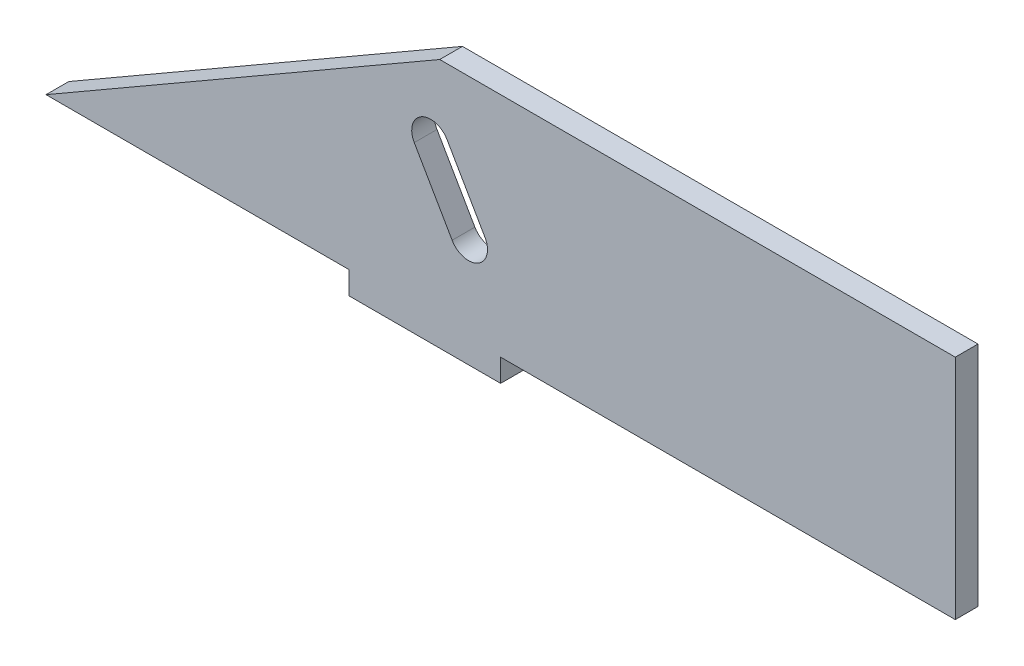
ISO-10303-21;
HEADER;
FILE_DESCRIPTION(('STEP AP214'),'2;1');
FILE_NAME('part.step','',(''),(''),'','','');
FILE_SCHEMA(('AUTOMOTIVE_DESIGN { 1 0 10303 214 1 1 1 1 }'));
ENDSEC;
DATA;
#1=APPLICATION_CONTEXT('core data for automotive mechanical design processes');
#2=APPLICATION_PROTOCOL_DEFINITION('international standard','automotive_design',2000,#1);
#3=PRODUCT_CONTEXT('',#1,'mechanical');
#4=PRODUCT('Part','Part','',(#3));
#5=PRODUCT_RELATED_PRODUCT_CATEGORY('part','',(#4));
#6=PRODUCT_DEFINITION_FORMATION('','',#4);
#7=PRODUCT_DEFINITION_CONTEXT('part definition',#1,'design');
#8=PRODUCT_DEFINITION('design','',#6,#7);
#9=PRODUCT_DEFINITION_SHAPE('','',#8);
#10=(LENGTH_UNIT() NAMED_UNIT(*) SI_UNIT(.MILLI.,.METRE.));
#11=(NAMED_UNIT(*) PLANE_ANGLE_UNIT() SI_UNIT($,.RADIAN.));
#12=(NAMED_UNIT(*) SI_UNIT($,.STERADIAN.) SOLID_ANGLE_UNIT());
#13=UNCERTAINTY_MEASURE_WITH_UNIT(LENGTH_MEASURE(1.E-05),#10,'distance_accuracy_value','');
#14=(GEOMETRIC_REPRESENTATION_CONTEXT(3) GLOBAL_UNCERTAINTY_ASSIGNED_CONTEXT((#13)) GLOBAL_UNIT_ASSIGNED_CONTEXT((#10,
#11,#12)) REPRESENTATION_CONTEXT('',''));
#15=CARTESIAN_POINT('',(0.,0.,0.));
#16=DIRECTION('',(0.,0.,1.));
#17=DIRECTION('',(1.,0.,0.));
#18=AXIS2_PLACEMENT_3D('',#15,#16,#17);
#19=CARTESIAN_POINT('',(50.,15.,3.));
#20=DIRECTION('',(0.,-1.,0.));
#21=DIRECTION('',(1.,0.,0.));
#22=AXIS2_PLACEMENT_3D('',#19,#20,#21);
#23=PLANE('',#22);
#24=DIRECTION('',(0.,0.,-1.));
#25=VECTOR('',#24,1.);
#26=CARTESIAN_POINT('',(1.96152422706574,15.,138.433806901228));
#27=LINE('',#26,#25);
#28=CARTESIAN_POINT('',(1.96152422706574,15.,3.00000000000006));
#29=VERTEX_POINT('',#28);
#30=CARTESIAN_POINT('',(1.9615242270659,15.,0.));
#31=VERTEX_POINT('',#30);
#32=EDGE_CURVE('E195',#29,#31,#27,.T.);
#33=ORIENTED_EDGE('',*,*,#32,.F.);
#34=DIRECTION('',(-1.,0.,0.));
#35=VECTOR('',#34,1.);
#36=CARTESIAN_POINT('',(50.,15.,3.));
#37=LINE('',#36,#35);
#38=CARTESIAN_POINT('',(70.,15.,3.));
#39=VERTEX_POINT('',#38);
#40=EDGE_CURVE('E141',#39,#29,#37,.T.);
#41=ORIENTED_EDGE('',*,*,#40,.F.);
#42=DIRECTION('',(0.,0.,1.));
#43=VECTOR('',#42,1.);
#44=CARTESIAN_POINT('',(70.,15.,3.));
#45=LINE('',#44,#43);
#46=CARTESIAN_POINT('',(70.,15.,0.));
#47=VERTEX_POINT('',#46);
#48=EDGE_CURVE('E157',#47,#39,#45,.T.);
#49=ORIENTED_EDGE('',*,*,#48,.F.);
#50=DIRECTION('',(-1.,0.,0.));
#51=VECTOR('',#50,1.);
#52=CARTESIAN_POINT('',(50.,15.,0.));
#53=LINE('',#52,#51);
#54=EDGE_CURVE('E205',#47,#31,#53,.T.);
#55=ORIENTED_EDGE('',*,*,#54,.T.);
#56=EDGE_LOOP('',(#33,#41,#49,#55));
#57=FACE_BOUND('',#56,.T.);
#58=ADVANCED_FACE('F39',(#57),#23,.F.);
#59=CARTESIAN_POINT('',(-10.,-15.,3.));
#60=DIRECTION('',(0.,1.,0.));
#61=DIRECTION('',(-1.,0.,0.));
#62=AXIS2_PLACEMENT_3D('',#59,#60,#61);
#63=PLANE('',#62);
#64=DIRECTION('',(1.,0.,0.));
#65=VECTOR('',#64,1.);
#66=CARTESIAN_POINT('',(-10.,-15.,0.));
#67=LINE('',#66,#65);
#68=CARTESIAN_POINT('',(-50.,-15.,0.));
#69=VERTEX_POINT('',#68);
#70=CARTESIAN_POINT('',(-10.,-15.,0.));
#71=VERTEX_POINT('',#70);
#72=EDGE_CURVE('E194',#69,#71,#67,.T.);
#73=ORIENTED_EDGE('',*,*,#72,.T.);
#74=DIRECTION('',(0.,0.,-1.));
#75=VECTOR('',#74,1.);
#76=CARTESIAN_POINT('',(-10.,-15.,3.));
#77=LINE('',#76,#75);
#78=CARTESIAN_POINT('',(-10.,-15.,3.));
#79=VERTEX_POINT('',#78);
#80=EDGE_CURVE('E242',#79,#71,#77,.T.);
#81=ORIENTED_EDGE('',*,*,#80,.F.);
#82=DIRECTION('',(1.,0.,0.));
#83=VECTOR('',#82,1.);
#84=CARTESIAN_POINT('',(-10.,-15.,3.));
#85=LINE('',#84,#83);
#86=CARTESIAN_POINT('',(-50.,-15.,3.));
#87=VERTEX_POINT('',#86);
#88=EDGE_CURVE('E201',#87,#79,#85,.T.);
#89=ORIENTED_EDGE('',*,*,#88,.F.);
#90=DIRECTION('',(0.,0.,-1.));
#91=VECTOR('',#90,1.);
#92=CARTESIAN_POINT('',(-50.,-15.,3.));
#93=LINE('',#92,#91);
#94=EDGE_CURVE('E246',#87,#69,#93,.T.);
#95=ORIENTED_EDGE('',*,*,#94,.T.);
#96=EDGE_LOOP('',(#73,#81,#89,#95));
#97=FACE_BOUND('',#96,.T.);
#98=ADVANCED_FACE('F41',(#97),#63,.F.);
#99=CARTESIAN_POINT('',(-10.,-15.,3.));
#100=DIRECTION('',(1.,0.,0.));
#101=DIRECTION('',(0.,0.,-1.));
#102=AXIS2_PLACEMENT_3D('',#99,#100,#101);
#103=PLANE('',#102);
#104=DIRECTION('',(0.,-1.,0.));
#105=VECTOR('',#104,1.);
#106=CARTESIAN_POINT('',(-10.,-15.,0.));
#107=LINE('',#106,#105);
#108=CARTESIAN_POINT('',(-10.,-18.,0.));
#109=VERTEX_POINT('',#108);
#110=EDGE_CURVE('E218',#71,#109,#107,.T.);
#111=ORIENTED_EDGE('',*,*,#110,.T.);
#112=DIRECTION('',(0.,0.,-1.));
#113=VECTOR('',#112,1.);
#114=CARTESIAN_POINT('',(-10.,-18.,3.));
#115=LINE('',#114,#113);
#116=CARTESIAN_POINT('',(-10.,-18.,3.));
#117=VERTEX_POINT('',#116);
#118=EDGE_CURVE('E238',#117,#109,#115,.T.);
#119=ORIENTED_EDGE('',*,*,#118,.F.);
#120=DIRECTION('',(0.,-1.,0.));
#121=VECTOR('',#120,1.);
#122=CARTESIAN_POINT('',(-10.,-15.,3.));
#123=LINE('',#122,#121);
#124=EDGE_CURVE('E204',#79,#117,#123,.T.);
#125=ORIENTED_EDGE('',*,*,#124,.F.);
#126=ORIENTED_EDGE('',*,*,#80,.T.);
#127=EDGE_LOOP('',(#111,#119,#125,#126));
#128=FACE_BOUND('',#127,.T.);
#129=ADVANCED_FACE('F291',(#128),#103,.F.);
#130=CARTESIAN_POINT('',(-10.,-18.,3.));
#131=DIRECTION('',(0.,1.,0.));
#132=DIRECTION('',(0.,0.,1.));
#133=AXIS2_PLACEMENT_3D('',#130,#131,#132);
#134=PLANE('',#133);
#135=DIRECTION('',(1.,0.,0.));
#136=VECTOR('',#135,1.);
#137=CARTESIAN_POINT('',(-10.,-18.,0.));
#138=LINE('',#137,#136);
#139=CARTESIAN_POINT('',(10.,-18.,0.));
#140=VERTEX_POINT('',#139);
#141=EDGE_CURVE('E221',#109,#140,#138,.T.);
#142=ORIENTED_EDGE('',*,*,#141,.T.);
#143=DIRECTION('',(0.,0.,-1.));
#144=VECTOR('',#143,1.);
#145=CARTESIAN_POINT('',(10.,-18.,3.));
#146=LINE('',#145,#144);
#147=CARTESIAN_POINT('',(10.,-18.,3.));
#148=VERTEX_POINT('',#147);
#149=EDGE_CURVE('E234',#148,#140,#146,.T.);
#150=ORIENTED_EDGE('',*,*,#149,.F.);
#151=DIRECTION('',(1.,0.,0.));
#152=VECTOR('',#151,1.);
#153=CARTESIAN_POINT('',(-10.,-18.,3.));
#154=LINE('',#153,#152);
#155=EDGE_CURVE('E208',#117,#148,#154,.T.);
#156=ORIENTED_EDGE('',*,*,#155,.F.);
#157=ORIENTED_EDGE('',*,*,#118,.T.);
#158=EDGE_LOOP('',(#142,#150,#156,#157));
#159=FACE_BOUND('',#158,.T.);
#160=ADVANCED_FACE('F302',(#159),#134,.F.);
#161=CARTESIAN_POINT('',(10.,-18.,3.));
#162=DIRECTION('',(-1.,0.,0.));
#163=DIRECTION('',(0.,-1.,0.));
#164=AXIS2_PLACEMENT_3D('',#161,#162,#163);
#165=PLANE('',#164);
#166=DIRECTION('',(0.,1.,0.));
#167=VECTOR('',#166,1.);
#168=CARTESIAN_POINT('',(10.,-18.,0.));
#169=LINE('',#168,#167);
#170=CARTESIAN_POINT('',(10.,-15.,0.));
#171=VERTEX_POINT('',#170);
#172=EDGE_CURVE('E224',#140,#171,#169,.T.);
#173=ORIENTED_EDGE('',*,*,#172,.T.);
#174=DIRECTION('',(0.,0.,-1.));
#175=VECTOR('',#174,1.);
#176=CARTESIAN_POINT('',(10.,-15.,3.));
#177=LINE('',#176,#175);
#178=CARTESIAN_POINT('',(10.,-15.,3.));
#179=VERTEX_POINT('',#178);
#180=EDGE_CURVE('E215',#179,#171,#177,.T.);
#181=ORIENTED_EDGE('',*,*,#180,.F.);
#182=DIRECTION('',(0.,1.,0.));
#183=VECTOR('',#182,1.);
#184=CARTESIAN_POINT('',(10.,-18.,3.));
#185=LINE('',#184,#183);
#186=EDGE_CURVE('E136',#148,#179,#185,.T.);
#187=ORIENTED_EDGE('',*,*,#186,.F.);
#188=ORIENTED_EDGE('',*,*,#149,.T.);
#189=EDGE_LOOP('',(#173,#181,#187,#188));
#190=FACE_BOUND('',#189,.T.);
#191=ADVANCED_FACE('F299',(#190),#165,.F.);
#192=CARTESIAN_POINT('',(50.,-15.,3.));
#193=DIRECTION('',(0.,1.,0.));
#194=DIRECTION('',(-1.,0.,0.));
#195=AXIS2_PLACEMENT_3D('',#192,#193,#194);
#196=PLANE('',#195);
#197=DIRECTION('',(1.,0.,0.));
#198=VECTOR('',#197,1.);
#199=CARTESIAN_POINT('',(50.,-15.,0.));
#200=LINE('',#199,#198);
#201=CARTESIAN_POINT('',(70.,-15.,0.));
#202=VERTEX_POINT('',#201);
#203=EDGE_CURVE('E147',#171,#202,#200,.T.);
#204=ORIENTED_EDGE('',*,*,#203,.T.);
#205=DIRECTION('',(0.,0.,-1.));
#206=VECTOR('',#205,1.);
#207=CARTESIAN_POINT('',(70.,-15.,3.));
#208=LINE('',#207,#206);
#209=CARTESIAN_POINT('',(70.,-15.,3.));
#210=VERTEX_POINT('',#209);
#211=EDGE_CURVE('E144',#210,#202,#208,.T.);
#212=ORIENTED_EDGE('',*,*,#211,.F.);
#213=DIRECTION('',(1.,0.,0.));
#214=VECTOR('',#213,1.);
#215=CARTESIAN_POINT('',(50.,-15.,3.));
#216=LINE('',#215,#214);
#217=EDGE_CURVE('E130',#179,#210,#216,.T.);
#218=ORIENTED_EDGE('',*,*,#217,.F.);
#219=ORIENTED_EDGE('',*,*,#180,.T.);
#220=EDGE_LOOP('',(#204,#212,#218,#219));
#221=FACE_BOUND('',#220,.T.);
#222=ADVANCED_FACE('F145',(#221),#196,.F.);
#223=CARTESIAN_POINT('',(0.,0.,3.));
#224=DIRECTION('',(0.,0.,1.));
#225=DIRECTION('',(1.,0.,0.));
#226=AXIS2_PLACEMENT_3D('',#223,#224,#225);
#227=PLANE('',#226);
#228=CARTESIAN_POINT('',(5.76537180435926,-3.58845726812014,3.));
#229=DIRECTION('',(0.,0.,1.));
#230=DIRECTION('',(1.,0.,0.));
#231=AXIS2_PLACEMENT_3D('',#228,#229,#230);
#232=CIRCLE('',#231,2.5);
#233=CARTESIAN_POINT('',(3.60030829489816,-4.83845726812014,3.));
#234=VERTEX_POINT('',#233);
#235=CARTESIAN_POINT('',(7.93043531382035,-2.33845726812014,3.));
#236=VERTEX_POINT('',#235);
#237=EDGE_CURVE('E55',#234,#236,#232,.T.);
#238=ORIENTED_EDGE('',*,*,#237,.F.);
#239=DIRECTION('',(0.5,-0.866025403784439,0.));
#240=VECTOR('',#239,1.);
#241=CARTESIAN_POINT('',(3.60030829489816,-4.83845726812014,3.));
#242=LINE('',#241,#240);
#243=CARTESIAN_POINT('',(-1.39969170510184,3.82179676972425,3.));
#244=VERTEX_POINT('',#243);
#245=EDGE_CURVE('E174',#244,#234,#242,.T.);
#246=ORIENTED_EDGE('',*,*,#245,.F.);
#247=CARTESIAN_POINT('',(0.765371804359261,5.07179676972425,3.));
#248=DIRECTION('',(0.,0.,1.));
#249=DIRECTION('',(1.,0.,0.));
#250=AXIS2_PLACEMENT_3D('',#247,#248,#249);
#251=CIRCLE('',#250,2.5);
#252=CARTESIAN_POINT('',(2.93043531382036,6.32179676972425,3.));
#253=VERTEX_POINT('',#252);
#254=EDGE_CURVE('E170',#253,#244,#251,.T.);
#255=ORIENTED_EDGE('',*,*,#254,.F.);
#256=DIRECTION('',(-0.5,0.866025403784439,0.));
#257=VECTOR('',#256,1.);
#258=CARTESIAN_POINT('',(7.93043531382035,-2.33845726812014,3.));
#259=LINE('',#258,#257);
#260=EDGE_CURVE('E167',#236,#253,#259,.T.);
#261=ORIENTED_EDGE('',*,*,#260,.F.);
#262=EDGE_LOOP('',(#238,#246,#255,#261));
#263=FACE_BOUND('',#262,.T.);
#264=DIRECTION('',(0.866025403784436,0.500000000000004,0.));
#265=VECTOR('',#264,1.);
#266=CARTESIAN_POINT('',(-50.,-15.,3.));
#267=LINE('',#266,#265);
#268=EDGE_CURVE('E190',#87,#29,#267,.T.);
#269=ORIENTED_EDGE('',*,*,#268,.F.);
#270=ORIENTED_EDGE('',*,*,#88,.T.);
#271=ORIENTED_EDGE('',*,*,#124,.T.);
#272=ORIENTED_EDGE('',*,*,#155,.T.);
#273=ORIENTED_EDGE('',*,*,#186,.T.);
#274=ORIENTED_EDGE('',*,*,#217,.T.);
#275=DIRECTION('',(0.,-1.,0.));
#276=VECTOR('',#275,1.);
#277=CARTESIAN_POINT('',(70.,-15.,3.));
#278=LINE('',#277,#276);
#279=EDGE_CURVE('E134',#39,#210,#278,.T.);
#280=ORIENTED_EDGE('',*,*,#279,.F.);
#281=ORIENTED_EDGE('',*,*,#40,.T.);
#282=EDGE_LOOP('',(#269,#270,#271,#272,#273,#274,#280,#281));
#283=FACE_BOUND('',#282,.T.);
#284=ADVANCED_FACE('F132',(#263,#283),#227,.T.);
#285=CARTESIAN_POINT('',(0.,0.,0.));
#286=DIRECTION('',(0.,0.,1.));
#287=DIRECTION('',(1.,0.,0.));
#288=AXIS2_PLACEMENT_3D('',#285,#286,#287);
#289=PLANE('',#288);
#290=DIRECTION('',(0.5,-0.866025403784439,0.));
#291=VECTOR('',#290,1.);
#292=CARTESIAN_POINT('',(0.605117766514875,0.349364905388788,0.));
#293=LINE('',#292,#291);
#294=CARTESIAN_POINT('',(-1.39969170510184,3.82179676972425,0.));
#295=VERTEX_POINT('',#294);
#296=CARTESIAN_POINT('',(3.60030829489816,-4.83845726812014,0.));
#297=VERTEX_POINT('',#296);
#298=EDGE_CURVE('E48',#295,#297,#293,.T.);
#299=ORIENTED_EDGE('',*,*,#298,.T.);
#300=CARTESIAN_POINT('',(5.76537180435926,-3.58845726812014,0.));
#301=DIRECTION('',(0.,0.,1.));
#302=DIRECTION('',(1.,0.,0.));
#303=AXIS2_PLACEMENT_3D('',#300,#301,#302);
#304=CIRCLE('',#303,2.5);
#305=CARTESIAN_POINT('',(7.93043531382035,-2.33845726812014,0.));
#306=VERTEX_POINT('',#305);
#307=EDGE_CURVE('E11',#297,#306,#304,.T.);
#308=ORIENTED_EDGE('',*,*,#307,.T.);
#309=DIRECTION('',(-0.5,0.866025403784439,0.));
#310=VECTOR('',#309,1.);
#311=CARTESIAN_POINT('',(4.93524478543707,2.84936490538879,0.));
#312=LINE('',#311,#310);
#313=CARTESIAN_POINT('',(2.93043531382036,6.32179676972425,0.));
#314=VERTEX_POINT('',#313);
#315=EDGE_CURVE('E250',#306,#314,#312,.T.);
#316=ORIENTED_EDGE('',*,*,#315,.T.);
#317=CARTESIAN_POINT('',(0.765371804359261,5.07179676972425,0.));
#318=DIRECTION('',(0.,0.,1.));
#319=DIRECTION('',(1.,0.,0.));
#320=AXIS2_PLACEMENT_3D('',#317,#318,#319);
#321=CIRCLE('',#320,2.5);
#322=EDGE_CURVE('E254',#314,#295,#321,.T.);
#323=ORIENTED_EDGE('',*,*,#322,.T.);
#324=EDGE_LOOP('',(#299,#308,#316,#323));
#325=FACE_BOUND('',#324,.T.);
#326=ORIENTED_EDGE('',*,*,#72,.F.);
#327=DIRECTION('',(0.866025403784436,0.500000000000004,0.));
#328=VECTOR('',#327,1.);
#329=CARTESIAN_POINT('',(-50.,-15.,0.));
#330=LINE('',#329,#328);
#331=EDGE_CURVE('E182',#69,#31,#330,.T.);
#332=ORIENTED_EDGE('',*,*,#331,.T.);
#333=ORIENTED_EDGE('',*,*,#54,.F.);
#334=DIRECTION('',(0.,1.,0.));
#335=VECTOR('',#334,1.);
#336=CARTESIAN_POINT('',(70.,-15.,0.));
#337=LINE('',#336,#335);
#338=EDGE_CURVE('E152',#202,#47,#337,.T.);
#339=ORIENTED_EDGE('',*,*,#338,.F.);
#340=ORIENTED_EDGE('',*,*,#203,.F.);
#341=ORIENTED_EDGE('',*,*,#172,.F.);
#342=ORIENTED_EDGE('',*,*,#141,.F.);
#343=ORIENTED_EDGE('',*,*,#110,.F.);
#344=EDGE_LOOP('',(#326,#332,#333,#339,#340,#341,#342,#343));
#345=FACE_BOUND('',#344,.T.);
#346=ADVANCED_FACE('F260',(#325,#345),#289,.F.);
#347=CARTESIAN_POINT('',(-50.,-15.,138.433806901228));
#348=DIRECTION('',(-0.500000000000004,0.866025403784436,0.));
#349=DIRECTION('',(-0.866025403784436,-0.500000000000004,0.));
#350=AXIS2_PLACEMENT_3D('',#347,#348,#349);
#351=PLANE('',#350);
#352=ORIENTED_EDGE('',*,*,#94,.F.);
#353=ORIENTED_EDGE('',*,*,#268,.T.);
#354=ORIENTED_EDGE('',*,*,#32,.T.);
#355=ORIENTED_EDGE('',*,*,#331,.F.);
#356=EDGE_LOOP('',(#352,#353,#354,#355));
#357=FACE_BOUND('',#356,.T.);
#358=ADVANCED_FACE('F275',(#357),#351,.T.);
#359=CARTESIAN_POINT('',(5.76537180435926,-3.58845726812014,-1.));
#360=DIRECTION('',(0.,0.,1.));
#361=DIRECTION('',(1.,0.,0.));
#362=AXIS2_PLACEMENT_3D('',#359,#360,#361);
#363=CYLINDRICAL_SURFACE('',#362,2.5);
#364=DIRECTION('',(0.,0.,1.));
#365=VECTOR('',#364,1.);
#366=CARTESIAN_POINT('',(3.60030829489816,-4.83845726812014,-1.));
#367=LINE('',#366,#365);
#368=EDGE_CURVE('E179',#297,#234,#367,.T.);
#369=ORIENTED_EDGE('',*,*,#368,.T.);
#370=ORIENTED_EDGE('',*,*,#237,.T.);
#371=DIRECTION('',(0.,0.,1.));
#372=VECTOR('',#371,1.);
#373=CARTESIAN_POINT('',(7.93043531382035,-2.33845726812014,-1.));
#374=LINE('',#373,#372);
#375=EDGE_CURVE('E178',#306,#236,#374,.T.);
#376=ORIENTED_EDGE('',*,*,#375,.F.);
#377=ORIENTED_EDGE('',*,*,#307,.F.);
#378=EDGE_LOOP('',(#369,#370,#376,#377));
#379=FACE_BOUND('',#378,.T.);
#380=ADVANCED_FACE('F273',(#379),#363,.F.);
#381=CARTESIAN_POINT('',(3.60030829489816,-4.83845726812014,-1.));
#382=DIRECTION('',(-0.866025403784439,-0.5,0.));
#383=DIRECTION('',(0.5,-0.866025403784439,0.));
#384=AXIS2_PLACEMENT_3D('',#381,#382,#383);
#385=PLANE('',#384);
#386=DIRECTION('',(0.,0.,1.));
#387=VECTOR('',#386,1.);
#388=CARTESIAN_POINT('',(-1.39969170510184,3.82179676972425,-1.));
#389=LINE('',#388,#387);
#390=EDGE_CURVE('E183',#295,#244,#389,.T.);
#391=ORIENTED_EDGE('',*,*,#390,.T.);
#392=ORIENTED_EDGE('',*,*,#245,.T.);
#393=ORIENTED_EDGE('',*,*,#368,.F.);
#394=ORIENTED_EDGE('',*,*,#298,.F.);
#395=EDGE_LOOP('',(#391,#392,#393,#394));
#396=FACE_BOUND('',#395,.T.);
#397=ADVANCED_FACE('F265',(#396),#385,.F.);
#398=CARTESIAN_POINT('',(0.765371804359261,5.07179676972425,-1.));
#399=DIRECTION('',(0.,0.,1.));
#400=DIRECTION('',(1.,0.,0.));
#401=AXIS2_PLACEMENT_3D('',#398,#399,#400);
#402=CYLINDRICAL_SURFACE('',#401,2.5);
#403=DIRECTION('',(0.,0.,1.));
#404=VECTOR('',#403,1.);
#405=CARTESIAN_POINT('',(2.93043531382036,6.32179676972425,-1.));
#406=LINE('',#405,#404);
#407=EDGE_CURVE('E63',#314,#253,#406,.T.);
#408=ORIENTED_EDGE('',*,*,#407,.T.);
#409=ORIENTED_EDGE('',*,*,#254,.T.);
#410=ORIENTED_EDGE('',*,*,#390,.F.);
#411=ORIENTED_EDGE('',*,*,#322,.F.);
#412=EDGE_LOOP('',(#408,#409,#410,#411));
#413=FACE_BOUND('',#412,.T.);
#414=ADVANCED_FACE('F267',(#413),#402,.F.);
#415=CARTESIAN_POINT('',(7.93043531382035,-2.33845726812014,-1.));
#416=DIRECTION('',(0.866025403784439,0.5,0.));
#417=DIRECTION('',(-0.5,0.866025403784439,0.));
#418=AXIS2_PLACEMENT_3D('',#415,#416,#417);
#419=PLANE('',#418);
#420=ORIENTED_EDGE('',*,*,#375,.T.);
#421=ORIENTED_EDGE('',*,*,#260,.T.);
#422=ORIENTED_EDGE('',*,*,#407,.F.);
#423=ORIENTED_EDGE('',*,*,#315,.F.);
#424=EDGE_LOOP('',(#420,#421,#422,#423));
#425=FACE_BOUND('',#424,.T.);
#426=ADVANCED_FACE('F272',(#425),#419,.F.);
#427=CARTESIAN_POINT('',(70.,0.,0.));
#428=DIRECTION('',(-1.,0.,0.));
#429=DIRECTION('',(0.,0.,1.));
#430=AXIS2_PLACEMENT_3D('',#427,#428,#429);
#431=PLANE('',#430);
#432=ORIENTED_EDGE('',*,*,#279,.T.);
#433=ORIENTED_EDGE('',*,*,#211,.T.);
#434=ORIENTED_EDGE('',*,*,#338,.T.);
#435=ORIENTED_EDGE('',*,*,#48,.T.);
#436=EDGE_LOOP('',(#432,#433,#434,#435));
#437=FACE_BOUND('',#436,.T.);
#438=ADVANCED_FACE('F155',(#437),#431,.F.);
#439=CLOSED_SHELL('',(#58,#98,#129,#160,#191,#222,#284,#346,#358,#380,#397,#414,#426,#438));
#440=MANIFOLD_SOLID_BREP('B2',#439);
#441=ADVANCED_BREP_SHAPE_REPRESENTATION('',(#18,#440),#14);
#442=SHAPE_DEFINITION_REPRESENTATION(#9,#441);
ENDSEC;
END-ISO-10303-21;
